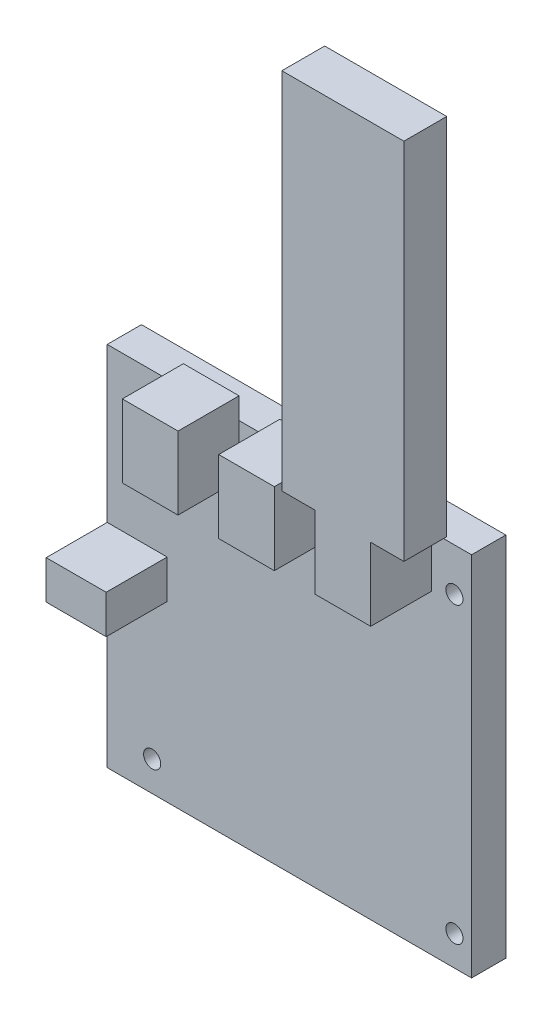
ISO-10303-21;
HEADER;
FILE_DESCRIPTION(('STEP AP214'),'2;1');
FILE_NAME('part.step','',(''),(''),'','','');
FILE_SCHEMA(('AUTOMOTIVE_DESIGN { 1 0 10303 214 1 1 1 1 }'));
ENDSEC;
DATA;
#1=APPLICATION_CONTEXT('core data for automotive mechanical design processes');
#2=APPLICATION_PROTOCOL_DEFINITION('international standard','automotive_design',2000,#1);
#3=PRODUCT_CONTEXT('',#1,'mechanical');
#4=PRODUCT('Part','Part','',(#3));
#5=PRODUCT_RELATED_PRODUCT_CATEGORY('part','',(#4));
#6=PRODUCT_DEFINITION_FORMATION('','',#4);
#7=PRODUCT_DEFINITION_CONTEXT('part definition',#1,'design');
#8=PRODUCT_DEFINITION('design','',#6,#7);
#9=PRODUCT_DEFINITION_SHAPE('','',#8);
#10=(LENGTH_UNIT() NAMED_UNIT(*) SI_UNIT(.MILLI.,.METRE.));
#11=(NAMED_UNIT(*) PLANE_ANGLE_UNIT() SI_UNIT($,.RADIAN.));
#12=(NAMED_UNIT(*) SI_UNIT($,.STERADIAN.) SOLID_ANGLE_UNIT());
#13=UNCERTAINTY_MEASURE_WITH_UNIT(LENGTH_MEASURE(1.E-05),#10,'distance_accuracy_value','');
#14=(GEOMETRIC_REPRESENTATION_CONTEXT(3) GLOBAL_UNCERTAINTY_ASSIGNED_CONTEXT((#13)) GLOBAL_UNIT_ASSIGNED_CONTEXT((#10,
#11,#12)) REPRESENTATION_CONTEXT('',''));
#15=CARTESIAN_POINT('',(0.,0.,0.));
#16=DIRECTION('',(0.,0.,1.));
#17=DIRECTION('',(1.,0.,0.));
#18=AXIS2_PLACEMENT_3D('',#15,#16,#17);
#19=CARTESIAN_POINT('',(20.245,47.8,22.25));
#20=DIRECTION('',(0.,-1.,0.));
#21=DIRECTION('',(0.,0.,-1.));
#22=AXIS2_PLACEMENT_3D('',#19,#20,#21);
#23=PLANE('',#22);
#24=DIRECTION('',(-1.,0.,0.));
#25=VECTOR('',#24,1.);
#26=CARTESIAN_POINT('',(12.495,47.8,12.25));
#27=LINE('',#26,#25);
#28=CARTESIAN_POINT('',(33.245,47.8,12.25));
#29=VERTEX_POINT('',#28);
#30=CARTESIAN_POINT('',(20.245,47.8,12.25));
#31=VERTEX_POINT('',#30);
#32=EDGE_CURVE('E11',#29,#31,#27,.T.);
#33=ORIENTED_EDGE('',*,*,#32,.F.);
#34=DIRECTION('',(0.,0.,-1.));
#35=VECTOR('',#34,1.);
#36=CARTESIAN_POINT('',(33.245,47.8,22.25));
#37=LINE('',#36,#35);
#38=CARTESIAN_POINT('',(33.245,47.8,8.));
#39=VERTEX_POINT('',#38);
#40=EDGE_CURVE('E281',#29,#39,#37,.T.);
#41=ORIENTED_EDGE('',*,*,#40,.T.);
#42=DIRECTION('',(-1.,0.,0.));
#43=VECTOR('',#42,1.);
#44=CARTESIAN_POINT('',(20.245,47.8,8.));
#45=LINE('',#44,#43);
#46=CARTESIAN_POINT('',(20.245,47.8,8.));
#47=VERTEX_POINT('',#46);
#48=EDGE_CURVE('E368',#39,#47,#45,.T.);
#49=ORIENTED_EDGE('',*,*,#48,.T.);
#50=DIRECTION('',(0.,0.,-1.));
#51=VECTOR('',#50,1.);
#52=CARTESIAN_POINT('',(20.245,47.8,22.25));
#53=LINE('',#52,#51);
#54=EDGE_CURVE('E282',#31,#47,#53,.T.);
#55=ORIENTED_EDGE('',*,*,#54,.F.);
#56=EDGE_LOOP('',(#33,#41,#49,#55));
#57=FACE_BOUND('',#56,.T.);
#58=ADVANCED_FACE('F33',(#57),#23,.F.);
#59=CARTESIAN_POINT('',(42.545,42.8,8.));
#60=DIRECTION('',(0.,0.,-1.));
#61=DIRECTION('',(-1.,0.,0.));
#62=AXIS2_PLACEMENT_3D('',#59,#60,#61);
#63=PLANE('',#62);
#64=CARTESIAN_POINT('',(38.545,-35.8,8.));
#65=DIRECTION('',(0.,0.,1.));
#66=DIRECTION('',(1.,0.,0.));
#67=AXIS2_PLACEMENT_3D('',#64,#65,#66);
#68=CIRCLE('',#67,2.);
#69=CARTESIAN_POINT('',(40.545,-35.8,8.));
#70=VERTEX_POINT('',#69);
#71=EDGE_CURVE('E303',#70,#70,#68,.T.);
#72=ORIENTED_EDGE('',*,*,#71,.F.);
#73=EDGE_LOOP('',(#72));
#74=FACE_BOUND('',#73,.T.);
#75=CARTESIAN_POINT('',(-32.045,32.8,8.));
#76=DIRECTION('',(0.,0.,1.));
#77=DIRECTION('',(1.,0.,0.));
#78=AXIS2_PLACEMENT_3D('',#75,#76,#77);
#79=CIRCLE('',#78,2.);
#80=CARTESIAN_POINT('',(-30.045,32.8,8.));
#81=VERTEX_POINT('',#80);
#82=EDGE_CURVE('E315',#81,#81,#79,.T.);
#83=ORIENTED_EDGE('',*,*,#82,.F.);
#84=EDGE_LOOP('',(#83));
#85=FACE_BOUND('',#84,.T.);
#86=CARTESIAN_POINT('',(38.545,32.8,8.));
#87=DIRECTION('',(0.,0.,1.));
#88=DIRECTION('',(1.,0.,0.));
#89=AXIS2_PLACEMENT_3D('',#86,#87,#88);
#90=CIRCLE('',#89,2.);
#91=CARTESIAN_POINT('',(40.545,32.8,8.));
#92=VERTEX_POINT('',#91);
#93=EDGE_CURVE('E309',#92,#92,#90,.T.);
#94=ORIENTED_EDGE('',*,*,#93,.F.);
#95=EDGE_LOOP('',(#94));
#96=FACE_BOUND('',#95,.T.);
#97=CARTESIAN_POINT('',(-32.045,-35.8,8.));
#98=DIRECTION('',(0.,0.,1.));
#99=DIRECTION('',(1.,0.,0.));
#100=AXIS2_PLACEMENT_3D('',#97,#98,#99);
#101=CIRCLE('',#100,2.);
#102=CARTESIAN_POINT('',(-30.045,-35.8,8.));
#103=VERTEX_POINT('',#102);
#104=EDGE_CURVE('E296',#103,#103,#101,.T.);
#105=ORIENTED_EDGE('',*,*,#104,.F.);
#106=EDGE_LOOP('',(#105));
#107=FACE_BOUND('',#106,.T.);
#108=DIRECTION('',(1.,0.,0.));
#109=VECTOR('',#108,1.);
#110=CARTESIAN_POINT('',(-42.545,-2.20000000000001,8.));
#111=LINE('',#110,#109);
#112=CARTESIAN_POINT('',(-42.545,-2.20000000000001,8.));
#113=VERTEX_POINT('',#112);
#114=CARTESIAN_POINT('',(-28.545,-2.20000000000001,8.));
#115=VERTEX_POINT('',#114);
#116=EDGE_CURVE('E476',#113,#115,#111,.T.);
#117=ORIENTED_EDGE('',*,*,#116,.F.);
#118=DIRECTION('',(0.,-1.,0.));
#119=VECTOR('',#118,1.);
#120=CARTESIAN_POINT('',(-42.545,-42.8,8.));
#121=LINE('',#120,#119);
#122=CARTESIAN_POINT('',(-42.545,-42.8,8.));
#123=VERTEX_POINT('',#122);
#124=EDGE_CURVE('E329',#113,#123,#121,.T.);
#125=ORIENTED_EDGE('',*,*,#124,.T.);
#126=DIRECTION('',(1.,0.,0.));
#127=VECTOR('',#126,1.);
#128=CARTESIAN_POINT('',(-42.545,-42.8,8.));
#129=LINE('',#128,#127);
#130=CARTESIAN_POINT('',(42.545,-42.8,8.));
#131=VERTEX_POINT('',#130);
#132=EDGE_CURVE('E333',#123,#131,#129,.T.);
#133=ORIENTED_EDGE('',*,*,#132,.T.);
#134=DIRECTION('',(0.,1.,0.));
#135=VECTOR('',#134,1.);
#136=CARTESIAN_POINT('',(42.545,-42.8,8.));
#137=LINE('',#136,#135);
#138=CARTESIAN_POINT('',(42.545,42.8,8.));
#139=VERTEX_POINT('',#138);
#140=EDGE_CURVE('E321',#131,#139,#137,.T.);
#141=ORIENTED_EDGE('',*,*,#140,.T.);
#142=DIRECTION('',(-1.,0.,0.));
#143=VECTOR('',#142,1.);
#144=CARTESIAN_POINT('',(-42.545,42.8,8.));
#145=LINE('',#144,#143);
#146=CARTESIAN_POINT('',(33.245,42.8,8.));
#147=VERTEX_POINT('',#146);
#148=EDGE_CURVE('E326',#139,#147,#145,.T.);
#149=ORIENTED_EDGE('',*,*,#148,.T.);
#150=DIRECTION('',(0.,1.,0.));
#151=VECTOR('',#150,1.);
#152=CARTESIAN_POINT('',(33.245,30.8,8.));
#153=LINE('',#152,#151);
#154=CARTESIAN_POINT('',(33.245,30.8,8.));
#155=VERTEX_POINT('',#154);
#156=EDGE_CURVE('E380',#155,#147,#153,.T.);
#157=ORIENTED_EDGE('',*,*,#156,.F.);
#158=DIRECTION('',(1.,0.,0.));
#159=VECTOR('',#158,1.);
#160=CARTESIAN_POINT('',(20.245,30.8,8.));
#161=LINE('',#160,#159);
#162=CARTESIAN_POINT('',(20.245,30.8,8.));
#163=VERTEX_POINT('',#162);
#164=EDGE_CURVE('E355',#163,#155,#161,.T.);
#165=ORIENTED_EDGE('',*,*,#164,.F.);
#166=DIRECTION('',(0.,-1.,0.));
#167=VECTOR('',#166,1.);
#168=CARTESIAN_POINT('',(20.245,30.8,8.));
#169=LINE('',#168,#167);
#170=CARTESIAN_POINT('',(20.245,42.8,8.));
#171=VERTEX_POINT('',#170);
#172=EDGE_CURVE('E42',#171,#163,#169,.T.);
#173=ORIENTED_EDGE('',*,*,#172,.F.);
#174=CARTESIAN_POINT('',(10.745,42.8,8.));
#175=VERTEX_POINT('',#174);
#176=EDGE_CURVE('E720',#171,#175,#145,.T.);
#177=ORIENTED_EDGE('',*,*,#176,.T.);
#178=DIRECTION('',(0.,1.,0.));
#179=VECTOR('',#178,1.);
#180=CARTESIAN_POINT('',(10.745,30.8,8.));
#181=LINE('',#180,#179);
#182=CARTESIAN_POINT('',(10.745,30.8,8.));
#183=VERTEX_POINT('',#182);
#184=EDGE_CURVE('E538',#183,#175,#181,.T.);
#185=ORIENTED_EDGE('',*,*,#184,.F.);
#186=DIRECTION('',(1.,0.,0.));
#187=VECTOR('',#186,1.);
#188=CARTESIAN_POINT('',(10.745,30.8,8.));
#189=LINE('',#188,#187);
#190=CARTESIAN_POINT('',(-2.255,30.8,8.));
#191=VERTEX_POINT('',#190);
#192=EDGE_CURVE('E531',#191,#183,#189,.T.);
#193=ORIENTED_EDGE('',*,*,#192,.F.);
#194=DIRECTION('',(0.,-1.,0.));
#195=VECTOR('',#194,1.);
#196=CARTESIAN_POINT('',(-2.255,30.8,8.));
#197=LINE('',#196,#195);
#198=CARTESIAN_POINT('',(-2.25500000000001,42.8,8.));
#199=VERTEX_POINT('',#198);
#200=EDGE_CURVE('E543',#199,#191,#197,.T.);
#201=ORIENTED_EDGE('',*,*,#200,.F.);
#202=CARTESIAN_POINT('',(-11.755,42.8,8.));
#203=VERTEX_POINT('',#202);
#204=EDGE_CURVE('E719',#199,#203,#145,.T.);
#205=ORIENTED_EDGE('',*,*,#204,.T.);
#206=DIRECTION('',(0.,1.,0.));
#207=VECTOR('',#206,1.);
#208=CARTESIAN_POINT('',(-11.755,30.8,8.));
#209=LINE('',#208,#207);
#210=CARTESIAN_POINT('',(-11.755,30.8,8.));
#211=VERTEX_POINT('',#210);
#212=EDGE_CURVE('E511',#211,#203,#209,.T.);
#213=ORIENTED_EDGE('',*,*,#212,.F.);
#214=DIRECTION('',(1.,0.,0.));
#215=VECTOR('',#214,1.);
#216=CARTESIAN_POINT('',(-24.755,30.8,8.));
#217=LINE('',#216,#215);
#218=CARTESIAN_POINT('',(-24.755,30.8,8.));
#219=VERTEX_POINT('',#218);
#220=EDGE_CURVE('E507',#219,#211,#217,.T.);
#221=ORIENTED_EDGE('',*,*,#220,.F.);
#222=DIRECTION('',(0.,-1.,0.));
#223=VECTOR('',#222,1.);
#224=CARTESIAN_POINT('',(-24.755,30.8,8.));
#225=LINE('',#224,#223);
#226=CARTESIAN_POINT('',(-24.755,42.8,8.));
#227=VERTEX_POINT('',#226);
#228=EDGE_CURVE('E484',#227,#219,#225,.T.);
#229=ORIENTED_EDGE('',*,*,#228,.F.);
#230=CARTESIAN_POINT('',(-42.545,42.8,8.));
#231=VERTEX_POINT('',#230);
#232=EDGE_CURVE('E324',#227,#231,#145,.T.);
#233=ORIENTED_EDGE('',*,*,#232,.T.);
#234=CARTESIAN_POINT('',(-42.545,6.79999999999999,8.));
#235=VERTEX_POINT('',#234);
#236=EDGE_CURVE('E331',#231,#235,#121,.T.);
#237=ORIENTED_EDGE('',*,*,#236,.T.);
#238=DIRECTION('',(-1.,0.,0.));
#239=VECTOR('',#238,1.);
#240=CARTESIAN_POINT('',(-42.545,6.79999999999999,8.));
#241=LINE('',#240,#239);
#242=CARTESIAN_POINT('',(-28.545,6.79999999999999,8.));
#243=VERTEX_POINT('',#242);
#244=EDGE_CURVE('E722',#243,#235,#241,.T.);
#245=ORIENTED_EDGE('',*,*,#244,.F.);
#246=DIRECTION('',(0.,1.,0.));
#247=VECTOR('',#246,1.);
#248=CARTESIAN_POINT('',(-28.545,6.79999999999999,8.));
#249=LINE('',#248,#247);
#250=EDGE_CURVE('E58',#115,#243,#249,.T.);
#251=ORIENTED_EDGE('',*,*,#250,.F.);
#252=EDGE_LOOP('',(#117,#125,#133,#141,#149,#157,#165,#173,#177,#185,#193,#201,#205,#213,#221,
#229,#233,#237,#245,#251));
#253=FACE_BOUND('',#252,.T.);
#254=ADVANCED_FACE('F415',(#74,#85,#96,#107,#253),#63,.F.);
#255=CARTESIAN_POINT('',(42.545,42.8,0.));
#256=DIRECTION('',(0.,0.,-1.));
#257=DIRECTION('',(-1.,0.,0.));
#258=AXIS2_PLACEMENT_3D('',#255,#256,#257);
#259=PLANE('',#258);
#260=CARTESIAN_POINT('',(38.545,-35.8,0.));
#261=DIRECTION('',(0.,0.,1.));
#262=DIRECTION('',(1.,0.,0.));
#263=AXIS2_PLACEMENT_3D('',#260,#261,#262);
#264=CIRCLE('',#263,2.);
#265=CARTESIAN_POINT('',(40.545,-35.8,0.));
#266=VERTEX_POINT('',#265);
#267=EDGE_CURVE('E299',#266,#266,#264,.T.);
#268=ORIENTED_EDGE('',*,*,#267,.T.);
#269=EDGE_LOOP('',(#268));
#270=FACE_BOUND('',#269,.T.);
#271=CARTESIAN_POINT('',(-32.045,32.8,0.));
#272=DIRECTION('',(0.,0.,1.));
#273=DIRECTION('',(1.,0.,0.));
#274=AXIS2_PLACEMENT_3D('',#271,#272,#273);
#275=CIRCLE('',#274,2.);
#276=CARTESIAN_POINT('',(-30.045,32.8,0.));
#277=VERTEX_POINT('',#276);
#278=EDGE_CURVE('E312',#277,#277,#275,.T.);
#279=ORIENTED_EDGE('',*,*,#278,.T.);
#280=EDGE_LOOP('',(#279));
#281=FACE_BOUND('',#280,.T.);
#282=DIRECTION('',(0.,1.,0.));
#283=VECTOR('',#282,1.);
#284=CARTESIAN_POINT('',(42.545,-42.8,0.));
#285=LINE('',#284,#283);
#286=CARTESIAN_POINT('',(42.545,-42.8,0.));
#287=VERTEX_POINT('',#286);
#288=CARTESIAN_POINT('',(42.545,42.8,0.));
#289=VERTEX_POINT('',#288);
#290=EDGE_CURVE('E318',#287,#289,#285,.T.);
#291=ORIENTED_EDGE('',*,*,#290,.F.);
#292=DIRECTION('',(1.,0.,0.));
#293=VECTOR('',#292,1.);
#294=CARTESIAN_POINT('',(-42.545,-42.8,0.));
#295=LINE('',#294,#293);
#296=CARTESIAN_POINT('',(-42.545,-42.8,0.));
#297=VERTEX_POINT('',#296);
#298=EDGE_CURVE('E325',#297,#287,#295,.T.);
#299=ORIENTED_EDGE('',*,*,#298,.F.);
#300=DIRECTION('',(0.,-1.,0.));
#301=VECTOR('',#300,1.);
#302=CARTESIAN_POINT('',(-42.545,-42.8,0.));
#303=LINE('',#302,#301);
#304=CARTESIAN_POINT('',(-42.545,42.8,0.));
#305=VERTEX_POINT('',#304);
#306=EDGE_CURVE('E340',#305,#297,#303,.T.);
#307=ORIENTED_EDGE('',*,*,#306,.F.);
#308=DIRECTION('',(-1.,0.,0.));
#309=VECTOR('',#308,1.);
#310=CARTESIAN_POINT('',(-42.545,42.8,0.));
#311=LINE('',#310,#309);
#312=EDGE_CURVE('E338',#289,#305,#311,.T.);
#313=ORIENTED_EDGE('',*,*,#312,.F.);
#314=EDGE_LOOP('',(#291,#299,#307,#313));
#315=FACE_BOUND('',#314,.T.);
#316=CARTESIAN_POINT('',(38.545,32.8,0.));
#317=DIRECTION('',(0.,0.,1.));
#318=DIRECTION('',(1.,0.,0.));
#319=AXIS2_PLACEMENT_3D('',#316,#317,#318);
#320=CIRCLE('',#319,2.);
#321=CARTESIAN_POINT('',(40.545,32.8,0.));
#322=VERTEX_POINT('',#321);
#323=EDGE_CURVE('E306',#322,#322,#320,.T.);
#324=ORIENTED_EDGE('',*,*,#323,.T.);
#325=EDGE_LOOP('',(#324));
#326=FACE_BOUND('',#325,.T.);
#327=CARTESIAN_POINT('',(-32.045,-35.8,0.));
#328=DIRECTION('',(0.,0.,1.));
#329=DIRECTION('',(1.,0.,0.));
#330=AXIS2_PLACEMENT_3D('',#327,#328,#329);
#331=CIRCLE('',#330,2.);
#332=CARTESIAN_POINT('',(-30.045,-35.8,0.));
#333=VERTEX_POINT('',#332);
#334=EDGE_CURVE('E300',#333,#333,#331,.T.);
#335=ORIENTED_EDGE('',*,*,#334,.T.);
#336=EDGE_LOOP('',(#335));
#337=FACE_BOUND('',#336,.T.);
#338=ADVANCED_FACE('F422',(#270,#281,#315,#326,#337),#259,.T.);
#339=CARTESIAN_POINT('',(42.545,-42.8,8.));
#340=DIRECTION('',(-1.,0.,0.));
#341=DIRECTION('',(0.,0.,1.));
#342=AXIS2_PLACEMENT_3D('',#339,#340,#341);
#343=PLANE('',#342);
#344=ORIENTED_EDGE('',*,*,#290,.T.);
#345=DIRECTION('',(0.,0.,-1.));
#346=VECTOR('',#345,1.);
#347=CARTESIAN_POINT('',(42.545,42.8,8.));
#348=LINE('',#347,#346);
#349=EDGE_CURVE('E351',#139,#289,#348,.T.);
#350=ORIENTED_EDGE('',*,*,#349,.F.);
#351=ORIENTED_EDGE('',*,*,#140,.F.);
#352=DIRECTION('',(0.,0.,-1.));
#353=VECTOR('',#352,1.);
#354=CARTESIAN_POINT('',(42.545,-42.8,8.));
#355=LINE('',#354,#353);
#356=EDGE_CURVE('E335',#131,#287,#355,.T.);
#357=ORIENTED_EDGE('',*,*,#356,.T.);
#358=EDGE_LOOP('',(#344,#350,#351,#357));
#359=FACE_BOUND('',#358,.T.);
#360=ADVANCED_FACE('F35',(#359),#343,.F.);
#361=CARTESIAN_POINT('',(-42.545,42.8,8.));
#362=DIRECTION('',(0.,-1.,0.));
#363=DIRECTION('',(0.,0.,-1.));
#364=AXIS2_PLACEMENT_3D('',#361,#362,#363);
#365=PLANE('',#364);
#366=ORIENTED_EDGE('',*,*,#312,.T.);
#367=DIRECTION('',(0.,0.,-1.));
#368=VECTOR('',#367,1.);
#369=CARTESIAN_POINT('',(-42.545,42.8,8.));
#370=LINE('',#369,#368);
#371=EDGE_CURVE('E348',#231,#305,#370,.T.);
#372=ORIENTED_EDGE('',*,*,#371,.F.);
#373=ORIENTED_EDGE('',*,*,#232,.F.);
#374=EDGE_CURVE('E717',#203,#227,#145,.T.);
#375=ORIENTED_EDGE('',*,*,#374,.F.);
#376=ORIENTED_EDGE('',*,*,#204,.F.);
#377=EDGE_CURVE('E571',#175,#199,#145,.T.);
#378=ORIENTED_EDGE('',*,*,#377,.F.);
#379=ORIENTED_EDGE('',*,*,#176,.F.);
#380=EDGE_CURVE('E330',#147,#171,#145,.T.);
#381=ORIENTED_EDGE('',*,*,#380,.F.);
#382=ORIENTED_EDGE('',*,*,#148,.F.);
#383=ORIENTED_EDGE('',*,*,#349,.T.);
#384=EDGE_LOOP('',(#366,#372,#373,#375,#376,#378,#379,#381,#382,#383));
#385=FACE_BOUND('',#384,.T.);
#386=ADVANCED_FACE('F454',(#385),#365,.F.);
#387=CARTESIAN_POINT('',(-42.545,-42.8,8.));
#388=DIRECTION('',(1.,0.,0.));
#389=DIRECTION('',(0.,0.,-1.));
#390=AXIS2_PLACEMENT_3D('',#387,#388,#389);
#391=PLANE('',#390);
#392=CARTESIAN_POINT('',(-42.545,2.29999999999999,16.25));
#393=DIRECTION('',(-1.,0.,0.));
#394=DIRECTION('',(0.,0.,1.));
#395=AXIS2_PLACEMENT_3D('',#392,#393,#394);
#396=CIRCLE('',#395,2.5);
#397=CARTESIAN_POINT('',(-42.545,2.29999999999999,18.75));
#398=VERTEX_POINT('',#397);
#399=EDGE_CURVE('E248',#398,#398,#396,.T.);
#400=ORIENTED_EDGE('',*,*,#399,.F.);
#401=EDGE_LOOP('',(#400));
#402=FACE_BOUND('',#401,.T.);
#403=ORIENTED_EDGE('',*,*,#306,.T.);
#404=DIRECTION('',(0.,0.,-1.));
#405=VECTOR('',#404,1.);
#406=CARTESIAN_POINT('',(-42.545,-42.8,8.));
#407=LINE('',#406,#405);
#408=EDGE_CURVE('E345',#123,#297,#407,.T.);
#409=ORIENTED_EDGE('',*,*,#408,.F.);
#410=ORIENTED_EDGE('',*,*,#124,.F.);
#411=DIRECTION('',(0.,0.,-1.));
#412=VECTOR('',#411,1.);
#413=CARTESIAN_POINT('',(-42.545,-2.20000000000001,22.25));
#414=LINE('',#413,#412);
#415=CARTESIAN_POINT('',(-42.545,-2.20000000000001,22.25));
#416=VERTEX_POINT('',#415);
#417=EDGE_CURVE('E480',#416,#113,#414,.T.);
#418=ORIENTED_EDGE('',*,*,#417,.F.);
#419=DIRECTION('',(0.,-1.,0.));
#420=VECTOR('',#419,1.);
#421=CARTESIAN_POINT('',(-42.545,6.79999999999999,22.25));
#422=LINE('',#421,#420);
#423=CARTESIAN_POINT('',(-42.545,6.79999999999999,22.25));
#424=VERTEX_POINT('',#423);
#425=EDGE_CURVE('E482',#424,#416,#422,.T.);
#426=ORIENTED_EDGE('',*,*,#425,.F.);
#427=DIRECTION('',(0.,0.,-1.));
#428=VECTOR('',#427,1.);
#429=CARTESIAN_POINT('',(-42.545,6.79999999999999,22.25));
#430=LINE('',#429,#428);
#431=EDGE_CURVE('E726',#424,#235,#430,.T.);
#432=ORIENTED_EDGE('',*,*,#431,.T.);
#433=ORIENTED_EDGE('',*,*,#236,.F.);
#434=ORIENTED_EDGE('',*,*,#371,.T.);
#435=EDGE_LOOP('',(#403,#409,#410,#418,#426,#432,#433,#434));
#436=FACE_BOUND('',#435,.T.);
#437=ADVANCED_FACE('F451',(#402,#436),#391,.F.);
#438=CARTESIAN_POINT('',(-42.545,-42.8,8.));
#439=DIRECTION('',(0.,1.,0.));
#440=DIRECTION('',(0.,0.,1.));
#441=AXIS2_PLACEMENT_3D('',#438,#439,#440);
#442=PLANE('',#441);
#443=ORIENTED_EDGE('',*,*,#298,.T.);
#444=ORIENTED_EDGE('',*,*,#356,.F.);
#445=ORIENTED_EDGE('',*,*,#132,.F.);
#446=ORIENTED_EDGE('',*,*,#408,.T.);
#447=EDGE_LOOP('',(#443,#444,#445,#446));
#448=FACE_BOUND('',#447,.T.);
#449=ADVANCED_FACE('F443',(#448),#442,.F.);
#450=CARTESIAN_POINT('',(-32.045,32.8,8.));
#451=DIRECTION('',(0.,0.,-1.));
#452=DIRECTION('',(-1.,0.,0.));
#453=AXIS2_PLACEMENT_3D('',#450,#451,#452);
#454=CYLINDRICAL_SURFACE('',#453,2.);
#455=ORIENTED_EDGE('',*,*,#82,.T.);
#456=EDGE_LOOP('',(#455));
#457=FACE_BOUND('',#456,.T.);
#458=ORIENTED_EDGE('',*,*,#278,.F.);
#459=EDGE_LOOP('',(#458));
#460=FACE_BOUND('',#459,.T.);
#461=ADVANCED_FACE('F440',(#457,#460),#454,.F.);
#462=CARTESIAN_POINT('',(38.545,32.8,8.));
#463=DIRECTION('',(0.,0.,-1.));
#464=DIRECTION('',(-1.,0.,0.));
#465=AXIS2_PLACEMENT_3D('',#462,#463,#464);
#466=CYLINDRICAL_SURFACE('',#465,2.);
#467=ORIENTED_EDGE('',*,*,#93,.T.);
#468=EDGE_LOOP('',(#467));
#469=FACE_BOUND('',#468,.T.);
#470=ORIENTED_EDGE('',*,*,#323,.F.);
#471=EDGE_LOOP('',(#470));
#472=FACE_BOUND('',#471,.T.);
#473=ADVANCED_FACE('F436',(#469,#472),#466,.F.);
#474=CARTESIAN_POINT('',(38.545,-35.8,8.));
#475=DIRECTION('',(0.,0.,-1.));
#476=DIRECTION('',(-1.,0.,0.));
#477=AXIS2_PLACEMENT_3D('',#474,#475,#476);
#478=CYLINDRICAL_SURFACE('',#477,2.);
#479=ORIENTED_EDGE('',*,*,#71,.T.);
#480=EDGE_LOOP('',(#479));
#481=FACE_BOUND('',#480,.T.);
#482=ORIENTED_EDGE('',*,*,#267,.F.);
#483=EDGE_LOOP('',(#482));
#484=FACE_BOUND('',#483,.T.);
#485=ADVANCED_FACE('F432',(#481,#484),#478,.F.);
#486=CARTESIAN_POINT('',(-32.045,-35.8,8.));
#487=DIRECTION('',(0.,0.,-1.));
#488=DIRECTION('',(-1.,0.,0.));
#489=AXIS2_PLACEMENT_3D('',#486,#487,#488);
#490=CYLINDRICAL_SURFACE('',#489,2.);
#491=ORIENTED_EDGE('',*,*,#104,.T.);
#492=EDGE_LOOP('',(#491));
#493=FACE_BOUND('',#492,.T.);
#494=ORIENTED_EDGE('',*,*,#334,.F.);
#495=EDGE_LOOP('',(#494));
#496=FACE_BOUND('',#495,.T.);
#497=ADVANCED_FACE('F429',(#493,#496),#490,.F.);
#498=CARTESIAN_POINT('',(33.245,30.8,22.25));
#499=DIRECTION('',(-1.,0.,0.));
#500=DIRECTION('',(0.,0.,1.));
#501=AXIS2_PLACEMENT_3D('',#498,#499,#500);
#502=PLANE('',#501);
#503=ORIENTED_EDGE('',*,*,#156,.T.);
#504=EDGE_CURVE('E381',#147,#39,#153,.T.);
#505=ORIENTED_EDGE('',*,*,#504,.T.);
#506=ORIENTED_EDGE('',*,*,#40,.F.);
#507=CARTESIAN_POINT('',(33.245,47.8,22.25));
#508=VERTEX_POINT('',#507);
#509=EDGE_CURVE('E284',#508,#29,#37,.T.);
#510=ORIENTED_EDGE('',*,*,#509,.F.);
#511=DIRECTION('',(0.,1.,0.));
#512=VECTOR('',#511,1.);
#513=CARTESIAN_POINT('',(33.245,30.8,22.25));
#514=LINE('',#513,#512);
#515=CARTESIAN_POINT('',(33.245,30.8,22.25));
#516=VERTEX_POINT('',#515);
#517=EDGE_CURVE('E354',#516,#508,#514,.T.);
#518=ORIENTED_EDGE('',*,*,#517,.F.);
#519=DIRECTION('',(0.,0.,-1.));
#520=VECTOR('',#519,1.);
#521=CARTESIAN_POINT('',(33.245,30.8,22.25));
#522=LINE('',#521,#520);
#523=EDGE_CURVE('E371',#516,#155,#522,.T.);
#524=ORIENTED_EDGE('',*,*,#523,.T.);
#525=EDGE_LOOP('',(#503,#505,#506,#510,#518,#524));
#526=FACE_BOUND('',#525,.T.);
#527=ADVANCED_FACE('F396',(#526),#502,.F.);
#528=CARTESIAN_POINT('',(20.245,30.8,22.25));
#529=DIRECTION('',(1.,0.,0.));
#530=DIRECTION('',(0.,0.,-1.));
#531=AXIS2_PLACEMENT_3D('',#528,#529,#530);
#532=PLANE('',#531);
#533=EDGE_CURVE('E361',#47,#171,#169,.T.);
#534=ORIENTED_EDGE('',*,*,#533,.T.);
#535=ORIENTED_EDGE('',*,*,#172,.T.);
#536=DIRECTION('',(0.,0.,-1.));
#537=VECTOR('',#536,1.);
#538=CARTESIAN_POINT('',(20.245,30.8,22.25));
#539=LINE('',#538,#537);
#540=CARTESIAN_POINT('',(20.245,30.8,22.25));
#541=VERTEX_POINT('',#540);
#542=EDGE_CURVE('E286',#541,#163,#539,.T.);
#543=ORIENTED_EDGE('',*,*,#542,.F.);
#544=DIRECTION('',(0.,-1.,0.));
#545=VECTOR('',#544,1.);
#546=CARTESIAN_POINT('',(20.245,30.8,22.25));
#547=LINE('',#546,#545);
#548=CARTESIAN_POINT('',(20.245,47.8,22.25));
#549=VERTEX_POINT('',#548);
#550=EDGE_CURVE('E290',#549,#541,#547,.T.);
#551=ORIENTED_EDGE('',*,*,#550,.F.);
#552=EDGE_CURVE('E279',#549,#31,#53,.T.);
#553=ORIENTED_EDGE('',*,*,#552,.T.);
#554=ORIENTED_EDGE('',*,*,#54,.T.);
#555=EDGE_LOOP('',(#534,#535,#543,#551,#553,#554));
#556=FACE_BOUND('',#555,.T.);
#557=ADVANCED_FACE('F391',(#556),#532,.F.);
#558=CARTESIAN_POINT('',(20.245,30.8,22.25));
#559=DIRECTION('',(0.,1.,0.));
#560=DIRECTION('',(0.,0.,1.));
#561=AXIS2_PLACEMENT_3D('',#558,#559,#560);
#562=PLANE('',#561);
#563=ORIENTED_EDGE('',*,*,#164,.T.);
#564=ORIENTED_EDGE('',*,*,#523,.F.);
#565=DIRECTION('',(1.,0.,0.));
#566=VECTOR('',#565,1.);
#567=CARTESIAN_POINT('',(20.245,30.8,22.25));
#568=LINE('',#567,#566);
#569=EDGE_CURVE('E359',#541,#516,#568,.T.);
#570=ORIENTED_EDGE('',*,*,#569,.F.);
#571=ORIENTED_EDGE('',*,*,#542,.T.);
#572=EDGE_LOOP('',(#563,#564,#570,#571));
#573=FACE_BOUND('',#572,.T.);
#574=ADVANCED_FACE('F395',(#573),#562,.F.);
#575=CARTESIAN_POINT('',(33.245,47.8,22.25));
#576=DIRECTION('',(0.,0.,-1.));
#577=DIRECTION('',(-1.,0.,0.));
#578=AXIS2_PLACEMENT_3D('',#575,#576,#577);
#579=PLANE('',#578);
#580=ORIENTED_EDGE('',*,*,#517,.T.);
#581=DIRECTION('',(1.,0.,0.));
#582=VECTOR('',#581,1.);
#583=CARTESIAN_POINT('',(12.495,47.8,22.25));
#584=LINE('',#583,#582);
#585=CARTESIAN_POINT('',(40.995,47.8,22.25));
#586=VERTEX_POINT('',#585);
#587=EDGE_CURVE('E260',#508,#586,#584,.T.);
#588=ORIENTED_EDGE('',*,*,#587,.T.);
#589=DIRECTION('',(0.,-1.,0.));
#590=VECTOR('',#589,1.);
#591=CARTESIAN_POINT('',(40.995,132.8,22.25));
#592=LINE('',#591,#590);
#593=CARTESIAN_POINT('',(40.995,132.8,22.25));
#594=VERTEX_POINT('',#593);
#595=EDGE_CURVE('E266',#594,#586,#592,.T.);
#596=ORIENTED_EDGE('',*,*,#595,.F.);
#597=DIRECTION('',(1.,0.,0.));
#598=VECTOR('',#597,1.);
#599=CARTESIAN_POINT('',(12.495,132.8,22.25));
#600=LINE('',#599,#598);
#601=CARTESIAN_POINT('',(12.495,132.8,22.25));
#602=VERTEX_POINT('',#601);
#603=EDGE_CURVE('E239',#602,#594,#600,.T.);
#604=ORIENTED_EDGE('',*,*,#603,.F.);
#605=DIRECTION('',(0.,-1.,0.));
#606=VECTOR('',#605,1.);
#607=CARTESIAN_POINT('',(12.495,132.8,22.25));
#608=LINE('',#607,#606);
#609=CARTESIAN_POINT('',(12.495,47.8,22.25));
#610=VERTEX_POINT('',#609);
#611=EDGE_CURVE('E253',#602,#610,#608,.T.);
#612=ORIENTED_EDGE('',*,*,#611,.T.);
#613=EDGE_CURVE('E243',#610,#549,#584,.T.);
#614=ORIENTED_EDGE('',*,*,#613,.T.);
#615=ORIENTED_EDGE('',*,*,#550,.T.);
#616=ORIENTED_EDGE('',*,*,#569,.T.);
#617=EDGE_LOOP('',(#580,#588,#596,#604,#612,#614,#615,#616));
#618=FACE_BOUND('',#617,.T.);
#619=ADVANCED_FACE('F272',(#618),#579,.F.);
#620=CARTESIAN_POINT('',(33.245,47.8,8.));
#621=DIRECTION('',(0.,0.,-1.));
#622=DIRECTION('',(-1.,0.,0.));
#623=AXIS2_PLACEMENT_3D('',#620,#621,#622);
#624=PLANE('',#623);
#625=ORIENTED_EDGE('',*,*,#504,.F.);
#626=ORIENTED_EDGE('',*,*,#380,.T.);
#627=ORIENTED_EDGE('',*,*,#533,.F.);
#628=ORIENTED_EDGE('',*,*,#48,.F.);
#629=EDGE_LOOP('',(#625,#626,#627,#628));
#630=FACE_BOUND('',#629,.T.);
#631=ADVANCED_FACE('F389',(#630),#624,.T.);
#632=CARTESIAN_POINT('',(10.745,47.8,8.));
#633=DIRECTION('',(0.,0.,1.));
#634=DIRECTION('',(1.,0.,0.));
#635=AXIS2_PLACEMENT_3D('',#632,#633,#634);
#636=PLANE('',#635);
#637=CARTESIAN_POINT('',(10.745,47.8,8.));
#638=VERTEX_POINT('',#637);
#639=EDGE_CURVE('E526',#175,#638,#181,.T.);
#640=ORIENTED_EDGE('',*,*,#639,.F.);
#641=ORIENTED_EDGE('',*,*,#377,.T.);
#642=CARTESIAN_POINT('',(-2.25500000000001,47.8,8.));
#643=VERTEX_POINT('',#642);
#644=EDGE_CURVE('E544',#643,#199,#197,.T.);
#645=ORIENTED_EDGE('',*,*,#644,.F.);
#646=DIRECTION('',(-1.,0.,0.));
#647=VECTOR('',#646,1.);
#648=CARTESIAN_POINT('',(10.745,47.8,8.));
#649=LINE('',#648,#647);
#650=EDGE_CURVE('E541',#638,#643,#649,.T.);
#651=ORIENTED_EDGE('',*,*,#650,.F.);
#652=EDGE_LOOP('',(#640,#641,#645,#651));
#653=FACE_BOUND('',#652,.T.);
#654=ADVANCED_FACE('F570',(#653),#636,.F.);
#655=CARTESIAN_POINT('',(10.745,30.8,22.25));
#656=DIRECTION('',(-1.,0.,0.));
#657=DIRECTION('',(0.,0.,1.));
#658=AXIS2_PLACEMENT_3D('',#655,#656,#657);
#659=PLANE('',#658);
#660=ORIENTED_EDGE('',*,*,#184,.T.);
#661=ORIENTED_EDGE('',*,*,#639,.T.);
#662=DIRECTION('',(0.,0.,-1.));
#663=VECTOR('',#662,1.);
#664=CARTESIAN_POINT('',(10.745,47.8,22.25));
#665=LINE('',#664,#663);
#666=CARTESIAN_POINT('',(10.745,47.8,22.25));
#667=VERTEX_POINT('',#666);
#668=EDGE_CURVE('E378',#667,#638,#665,.T.);
#669=ORIENTED_EDGE('',*,*,#668,.F.);
#670=DIRECTION('',(0.,1.,0.));
#671=VECTOR('',#670,1.);
#672=CARTESIAN_POINT('',(10.745,30.8,22.25));
#673=LINE('',#672,#671);
#674=CARTESIAN_POINT('',(10.745,30.8,22.25));
#675=VERTEX_POINT('',#674);
#676=EDGE_CURVE('E527',#675,#667,#673,.T.);
#677=ORIENTED_EDGE('',*,*,#676,.F.);
#678=DIRECTION('',(0.,0.,-1.));
#679=VECTOR('',#678,1.);
#680=CARTESIAN_POINT('',(10.745,30.8,22.25));
#681=LINE('',#680,#679);
#682=EDGE_CURVE('E537',#675,#183,#681,.T.);
#683=ORIENTED_EDGE('',*,*,#682,.T.);
#684=EDGE_LOOP('',(#660,#661,#669,#677,#683));
#685=FACE_BOUND('',#684,.T.);
#686=ADVANCED_FACE('F566',(#685),#659,.F.);
#687=CARTESIAN_POINT('',(10.745,47.8,22.25));
#688=DIRECTION('',(0.,-1.,0.));
#689=DIRECTION('',(0.,0.,-1.));
#690=AXIS2_PLACEMENT_3D('',#687,#688,#689);
#691=PLANE('',#690);
#692=ORIENTED_EDGE('',*,*,#650,.T.);
#693=DIRECTION('',(0.,0.,-1.));
#694=VECTOR('',#693,1.);
#695=CARTESIAN_POINT('',(-2.25500000000001,47.8,22.25));
#696=LINE('',#695,#694);
#697=CARTESIAN_POINT('',(-2.25500000000001,47.8,22.25));
#698=VERTEX_POINT('',#697);
#699=EDGE_CURVE('E553',#698,#643,#696,.T.);
#700=ORIENTED_EDGE('',*,*,#699,.F.);
#701=DIRECTION('',(-1.,0.,0.));
#702=VECTOR('',#701,1.);
#703=CARTESIAN_POINT('',(10.745,47.8,22.25));
#704=LINE('',#703,#702);
#705=EDGE_CURVE('E530',#667,#698,#704,.T.);
#706=ORIENTED_EDGE('',*,*,#705,.F.);
#707=ORIENTED_EDGE('',*,*,#668,.T.);
#708=EDGE_LOOP('',(#692,#700,#706,#707));
#709=FACE_BOUND('',#708,.T.);
#710=ADVANCED_FACE('F562',(#709),#691,.F.);
#711=CARTESIAN_POINT('',(-2.255,30.8,22.25));
#712=DIRECTION('',(1.,0.,0.));
#713=DIRECTION('',(0.,1.,0.));
#714=AXIS2_PLACEMENT_3D('',#711,#712,#713);
#715=PLANE('',#714);
#716=ORIENTED_EDGE('',*,*,#644,.T.);
#717=ORIENTED_EDGE('',*,*,#200,.T.);
#718=DIRECTION('',(0.,0.,-1.));
#719=VECTOR('',#718,1.);
#720=CARTESIAN_POINT('',(-2.255,30.8,22.25));
#721=LINE('',#720,#719);
#722=CARTESIAN_POINT('',(-2.255,30.8,22.25));
#723=VERTEX_POINT('',#722);
#724=EDGE_CURVE('E551',#723,#191,#721,.T.);
#725=ORIENTED_EDGE('',*,*,#724,.F.);
#726=DIRECTION('',(0.,-1.,0.));
#727=VECTOR('',#726,1.);
#728=CARTESIAN_POINT('',(-2.255,30.8,22.25));
#729=LINE('',#728,#727);
#730=EDGE_CURVE('E533',#698,#723,#729,.T.);
#731=ORIENTED_EDGE('',*,*,#730,.F.);
#732=ORIENTED_EDGE('',*,*,#699,.T.);
#733=EDGE_LOOP('',(#716,#717,#725,#731,#732));
#734=FACE_BOUND('',#733,.T.);
#735=ADVANCED_FACE('F573',(#734),#715,.F.);
#736=CARTESIAN_POINT('',(10.745,30.8,22.25));
#737=DIRECTION('',(0.,1.,0.));
#738=DIRECTION('',(0.,0.,1.));
#739=AXIS2_PLACEMENT_3D('',#736,#737,#738);
#740=PLANE('',#739);
#741=ORIENTED_EDGE('',*,*,#192,.T.);
#742=ORIENTED_EDGE('',*,*,#682,.F.);
#743=DIRECTION('',(1.,0.,0.));
#744=VECTOR('',#743,1.);
#745=CARTESIAN_POINT('',(10.745,30.8,22.25));
#746=LINE('',#745,#744);
#747=EDGE_CURVE('E535',#723,#675,#746,.T.);
#748=ORIENTED_EDGE('',*,*,#747,.F.);
#749=ORIENTED_EDGE('',*,*,#724,.T.);
#750=EDGE_LOOP('',(#741,#742,#748,#749));
#751=FACE_BOUND('',#750,.T.);
#752=ADVANCED_FACE('F579',(#751),#740,.F.);
#753=CARTESIAN_POINT('',(10.745,47.8,22.25));
#754=DIRECTION('',(0.,0.,1.));
#755=DIRECTION('',(1.,0.,0.));
#756=AXIS2_PLACEMENT_3D('',#753,#754,#755);
#757=PLANE('',#756);
#758=ORIENTED_EDGE('',*,*,#676,.T.);
#759=ORIENTED_EDGE('',*,*,#705,.T.);
#760=ORIENTED_EDGE('',*,*,#730,.T.);
#761=ORIENTED_EDGE('',*,*,#747,.T.);
#762=EDGE_LOOP('',(#758,#759,#760,#761));
#763=FACE_BOUND('',#762,.T.);
#764=ADVANCED_FACE('F582',(#763),#757,.T.);
#765=CARTESIAN_POINT('',(-24.755,47.8,8.));
#766=DIRECTION('',(0.,0.,-1.));
#767=DIRECTION('',(-1.,0.,0.));
#768=AXIS2_PLACEMENT_3D('',#765,#766,#767);
#769=PLANE('',#768);
#770=ORIENTED_EDGE('',*,*,#374,.T.);
#771=CARTESIAN_POINT('',(-24.755,47.8,8.));
#772=VERTEX_POINT('',#771);
#773=EDGE_CURVE('E488',#772,#227,#225,.T.);
#774=ORIENTED_EDGE('',*,*,#773,.F.);
#775=DIRECTION('',(-1.,0.,0.));
#776=VECTOR('',#775,1.);
#777=CARTESIAN_POINT('',(-24.755,47.8,8.));
#778=LINE('',#777,#776);
#779=CARTESIAN_POINT('',(-11.755,47.8,8.));
#780=VERTEX_POINT('',#779);
#781=EDGE_CURVE('E499',#780,#772,#778,.T.);
#782=ORIENTED_EDGE('',*,*,#781,.F.);
#783=EDGE_CURVE('E510',#203,#780,#209,.T.);
#784=ORIENTED_EDGE('',*,*,#783,.F.);
#785=EDGE_LOOP('',(#770,#774,#782,#784));
#786=FACE_BOUND('',#785,.T.);
#787=ADVANCED_FACE('F584',(#786),#769,.T.);
#788=CARTESIAN_POINT('',(-24.755,30.8,22.25));
#789=DIRECTION('',(1.,0.,0.));
#790=DIRECTION('',(0.,0.,-1.));
#791=AXIS2_PLACEMENT_3D('',#788,#789,#790);
#792=PLANE('',#791);
#793=ORIENTED_EDGE('',*,*,#773,.T.);
#794=ORIENTED_EDGE('',*,*,#228,.T.);
#795=DIRECTION('',(0.,0.,-1.));
#796=VECTOR('',#795,1.);
#797=CARTESIAN_POINT('',(-24.755,30.8,22.25));
#798=LINE('',#797,#796);
#799=CARTESIAN_POINT('',(-24.755,30.8,22.25));
#800=VERTEX_POINT('',#799);
#801=EDGE_CURVE('E523',#800,#219,#798,.T.);
#802=ORIENTED_EDGE('',*,*,#801,.F.);
#803=DIRECTION('',(0.,-1.,0.));
#804=VECTOR('',#803,1.);
#805=CARTESIAN_POINT('',(-24.755,30.8,22.25));
#806=LINE('',#805,#804);
#807=CARTESIAN_POINT('',(-24.755,47.8,22.25));
#808=VERTEX_POINT('',#807);
#809=EDGE_CURVE('E495',#808,#800,#806,.T.);
#810=ORIENTED_EDGE('',*,*,#809,.F.);
#811=DIRECTION('',(0.,0.,-1.));
#812=VECTOR('',#811,1.);
#813=CARTESIAN_POINT('',(-24.755,47.8,22.25));
#814=LINE('',#813,#812);
#815=EDGE_CURVE('E504',#808,#772,#814,.T.);
#816=ORIENTED_EDGE('',*,*,#815,.T.);
#817=EDGE_LOOP('',(#793,#794,#802,#810,#816));
#818=FACE_BOUND('',#817,.T.);
#819=ADVANCED_FACE('F590',(#818),#792,.F.);
#820=CARTESIAN_POINT('',(-24.755,30.8,22.25));
#821=DIRECTION('',(0.,1.,0.));
#822=DIRECTION('',(0.,0.,1.));
#823=AXIS2_PLACEMENT_3D('',#820,#821,#822);
#824=PLANE('',#823);
#825=ORIENTED_EDGE('',*,*,#220,.T.);
#826=DIRECTION('',(0.,0.,-1.));
#827=VECTOR('',#826,1.);
#828=CARTESIAN_POINT('',(-11.755,30.8,22.25));
#829=LINE('',#828,#827);
#830=CARTESIAN_POINT('',(-11.755,30.8,22.25));
#831=VERTEX_POINT('',#830);
#832=EDGE_CURVE('E520',#831,#211,#829,.T.);
#833=ORIENTED_EDGE('',*,*,#832,.F.);
#834=DIRECTION('',(1.,0.,0.));
#835=VECTOR('',#834,1.);
#836=CARTESIAN_POINT('',(-24.755,30.8,22.25));
#837=LINE('',#836,#835);
#838=EDGE_CURVE('E498',#800,#831,#837,.T.);
#839=ORIENTED_EDGE('',*,*,#838,.F.);
#840=ORIENTED_EDGE('',*,*,#801,.T.);
#841=EDGE_LOOP('',(#825,#833,#839,#840));
#842=FACE_BOUND('',#841,.T.);
#843=ADVANCED_FACE('F698',(#842),#824,.F.);
#844=CARTESIAN_POINT('',(-11.755,30.8,22.25));
#845=DIRECTION('',(-1.,0.,0.));
#846=DIRECTION('',(0.,0.,1.));
#847=AXIS2_PLACEMENT_3D('',#844,#845,#846);
#848=PLANE('',#847);
#849=ORIENTED_EDGE('',*,*,#212,.T.);
#850=ORIENTED_EDGE('',*,*,#783,.T.);
#851=DIRECTION('',(0.,0.,-1.));
#852=VECTOR('',#851,1.);
#853=CARTESIAN_POINT('',(-11.755,47.8,22.25));
#854=LINE('',#853,#852);
#855=CARTESIAN_POINT('',(-11.755,47.8,22.25));
#856=VERTEX_POINT('',#855);
#857=EDGE_CURVE('E517',#856,#780,#854,.T.);
#858=ORIENTED_EDGE('',*,*,#857,.F.);
#859=DIRECTION('',(0.,1.,0.));
#860=VECTOR('',#859,1.);
#861=CARTESIAN_POINT('',(-11.755,30.8,22.25));
#862=LINE('',#861,#860);
#863=EDGE_CURVE('E501',#831,#856,#862,.T.);
#864=ORIENTED_EDGE('',*,*,#863,.F.);
#865=ORIENTED_EDGE('',*,*,#832,.T.);
#866=EDGE_LOOP('',(#849,#850,#858,#864,#865));
#867=FACE_BOUND('',#866,.T.);
#868=ADVANCED_FACE('F695',(#867),#848,.F.);
#869=CARTESIAN_POINT('',(-24.755,47.8,22.25));
#870=DIRECTION('',(0.,-1.,0.));
#871=DIRECTION('',(0.,0.,-1.));
#872=AXIS2_PLACEMENT_3D('',#869,#870,#871);
#873=PLANE('',#872);
#874=ORIENTED_EDGE('',*,*,#781,.T.);
#875=ORIENTED_EDGE('',*,*,#815,.F.);
#876=DIRECTION('',(-1.,0.,0.));
#877=VECTOR('',#876,1.);
#878=CARTESIAN_POINT('',(-24.755,47.8,22.25));
#879=LINE('',#878,#877);
#880=EDGE_CURVE('E503',#856,#808,#879,.T.);
#881=ORIENTED_EDGE('',*,*,#880,.F.);
#882=ORIENTED_EDGE('',*,*,#857,.T.);
#883=EDGE_LOOP('',(#874,#875,#881,#882));
#884=FACE_BOUND('',#883,.T.);
#885=ADVANCED_FACE('F690',(#884),#873,.F.);
#886=CARTESIAN_POINT('',(-24.755,47.8,22.25));
#887=DIRECTION('',(0.,0.,-1.));
#888=DIRECTION('',(-1.,0.,0.));
#889=AXIS2_PLACEMENT_3D('',#886,#887,#888);
#890=PLANE('',#889);
#891=ORIENTED_EDGE('',*,*,#809,.T.);
#892=ORIENTED_EDGE('',*,*,#838,.T.);
#893=ORIENTED_EDGE('',*,*,#863,.T.);
#894=ORIENTED_EDGE('',*,*,#880,.T.);
#895=EDGE_LOOP('',(#891,#892,#893,#894));
#896=FACE_BOUND('',#895,.T.);
#897=ADVANCED_FACE('F688',(#896),#890,.F.);
#898=CARTESIAN_POINT('',(-42.545,-2.20000000000001,22.25));
#899=DIRECTION('',(0.,1.,0.));
#900=DIRECTION('',(-1.,0.,0.));
#901=AXIS2_PLACEMENT_3D('',#898,#899,#900);
#902=PLANE('',#901);
#903=ORIENTED_EDGE('',*,*,#116,.T.);
#904=DIRECTION('',(0.,0.,-1.));
#905=VECTOR('',#904,1.);
#906=CARTESIAN_POINT('',(-28.545,-2.20000000000001,22.25));
#907=LINE('',#906,#905);
#908=CARTESIAN_POINT('',(-28.545,-2.20000000000001,22.25));
#909=VERTEX_POINT('',#908);
#910=EDGE_CURVE('E485',#909,#115,#907,.T.);
#911=ORIENTED_EDGE('',*,*,#910,.F.);
#912=DIRECTION('',(1.,0.,0.));
#913=VECTOR('',#912,1.);
#914=CARTESIAN_POINT('',(-42.545,-2.20000000000001,22.25));
#915=LINE('',#914,#913);
#916=EDGE_CURVE('E737',#416,#909,#915,.T.);
#917=ORIENTED_EDGE('',*,*,#916,.F.);
#918=ORIENTED_EDGE('',*,*,#417,.T.);
#919=EDGE_LOOP('',(#903,#911,#917,#918));
#920=FACE_BOUND('',#919,.T.);
#921=ADVANCED_FACE('F684',(#920),#902,.F.);
#922=CARTESIAN_POINT('',(-28.545,6.79999999999999,22.25));
#923=DIRECTION('',(-1.,0.,0.));
#924=DIRECTION('',(0.,0.,1.));
#925=AXIS2_PLACEMENT_3D('',#922,#923,#924);
#926=PLANE('',#925);
#927=ORIENTED_EDGE('',*,*,#250,.T.);
#928=DIRECTION('',(0.,0.,-1.));
#929=VECTOR('',#928,1.);
#930=CARTESIAN_POINT('',(-28.545,6.79999999999999,22.25));
#931=LINE('',#930,#929);
#932=CARTESIAN_POINT('',(-28.545,6.79999999999999,22.25));
#933=VERTEX_POINT('',#932);
#934=EDGE_CURVE('E491',#933,#243,#931,.T.);
#935=ORIENTED_EDGE('',*,*,#934,.F.);
#936=DIRECTION('',(0.,1.,0.));
#937=VECTOR('',#936,1.);
#938=CARTESIAN_POINT('',(-28.545,6.79999999999999,22.25));
#939=LINE('',#938,#937);
#940=EDGE_CURVE('E731',#909,#933,#939,.T.);
#941=ORIENTED_EDGE('',*,*,#940,.F.);
#942=ORIENTED_EDGE('',*,*,#910,.T.);
#943=EDGE_LOOP('',(#927,#935,#941,#942));
#944=FACE_BOUND('',#943,.T.);
#945=ADVANCED_FACE('F680',(#944),#926,.F.);
#946=CARTESIAN_POINT('',(-42.545,6.79999999999999,22.25));
#947=DIRECTION('',(0.,-1.,0.));
#948=DIRECTION('',(0.,0.,-1.));
#949=AXIS2_PLACEMENT_3D('',#946,#947,#948);
#950=PLANE('',#949);
#951=ORIENTED_EDGE('',*,*,#244,.T.);
#952=ORIENTED_EDGE('',*,*,#431,.F.);
#953=DIRECTION('',(-1.,0.,0.));
#954=VECTOR('',#953,1.);
#955=CARTESIAN_POINT('',(-42.545,6.79999999999999,22.25));
#956=LINE('',#955,#954);
#957=EDGE_CURVE('E729',#933,#424,#956,.T.);
#958=ORIENTED_EDGE('',*,*,#957,.F.);
#959=ORIENTED_EDGE('',*,*,#934,.T.);
#960=EDGE_LOOP('',(#951,#952,#958,#959));
#961=FACE_BOUND('',#960,.T.);
#962=ADVANCED_FACE('F676',(#961),#950,.F.);
#963=CARTESIAN_POINT('',(-42.545,-2.20000000000001,22.25));
#964=DIRECTION('',(0.,0.,1.));
#965=DIRECTION('',(1.,0.,0.));
#966=AXIS2_PLACEMENT_3D('',#963,#964,#965);
#967=PLANE('',#966);
#968=ORIENTED_EDGE('',*,*,#425,.T.);
#969=ORIENTED_EDGE('',*,*,#916,.T.);
#970=ORIENTED_EDGE('',*,*,#940,.T.);
#971=ORIENTED_EDGE('',*,*,#957,.T.);
#972=EDGE_LOOP('',(#968,#969,#970,#971));
#973=FACE_BOUND('',#972,.T.);
#974=ADVANCED_FACE('F672',(#973),#967,.T.);
#975=CARTESIAN_POINT('',(-39.545,2.29999999999999,16.25));
#976=DIRECTION('',(-1.,0.,0.));
#977=DIRECTION('',(0.,0.,1.));
#978=AXIS2_PLACEMENT_3D('',#975,#976,#977);
#979=CYLINDRICAL_SURFACE('',#978,2.5);
#980=CARTESIAN_POINT('',(-39.545,2.29999999999999,16.25));
#981=DIRECTION('',(-1.,0.,0.));
#982=DIRECTION('',(0.,0.,1.));
#983=AXIS2_PLACEMENT_3D('',#980,#981,#982);
#984=CIRCLE('',#983,2.5);
#985=CARTESIAN_POINT('',(-39.545,2.29999999999999,18.75));
#986=VERTEX_POINT('',#985);
#987=EDGE_CURVE('E251',#986,#986,#984,.T.);
#988=ORIENTED_EDGE('',*,*,#987,.F.);
#989=EDGE_LOOP('',(#988));
#990=FACE_BOUND('',#989,.T.);
#991=ORIENTED_EDGE('',*,*,#399,.T.);
#992=EDGE_LOOP('',(#991));
#993=FACE_BOUND('',#992,.T.);
#994=ADVANCED_FACE('F668',(#990,#993),#979,.F.);
#995=CARTESIAN_POINT('',(-39.545,2.29999999999999,16.25));
#996=DIRECTION('',(-1.,0.,0.));
#997=DIRECTION('',(0.,0.,1.));
#998=AXIS2_PLACEMENT_3D('',#995,#996,#997);
#999=PLANE('',#998);
#1000=ORIENTED_EDGE('',*,*,#987,.T.);
#1001=EDGE_LOOP('',(#1000));
#1002=FACE_BOUND('',#1001,.T.);
#1003=ADVANCED_FACE('F631',(#1002),#999,.T.);
#1004=CARTESIAN_POINT('',(40.995,47.8,22.25));
#1005=DIRECTION('',(0.,1.,0.));
#1006=DIRECTION('',(0.,0.,1.));
#1007=AXIS2_PLACEMENT_3D('',#1004,#1005,#1006);
#1008=PLANE('',#1007);
#1009=ORIENTED_EDGE('',*,*,#587,.F.);
#1010=ORIENTED_EDGE('',*,*,#509,.T.);
#1011=CARTESIAN_POINT('',(40.995,47.8,12.25));
#1012=VERTEX_POINT('',#1011);
#1013=EDGE_CURVE('E44',#1012,#29,#27,.T.);
#1014=ORIENTED_EDGE('',*,*,#1013,.F.);
#1015=DIRECTION('',(0.,0.,-1.));
#1016=VECTOR('',#1015,1.);
#1017=CARTESIAN_POINT('',(40.995,47.8,12.25));
#1018=LINE('',#1017,#1016);
#1019=EDGE_CURVE('E247',#586,#1012,#1018,.T.);
#1020=ORIENTED_EDGE('',*,*,#1019,.F.);
#1021=EDGE_LOOP('',(#1009,#1010,#1014,#1020));
#1022=FACE_BOUND('',#1021,.T.);
#1023=ADVANCED_FACE('F400',(#1022),#1008,.F.);
#1024=CARTESIAN_POINT('',(40.995,132.8,12.25));
#1025=DIRECTION('',(-1.,0.,0.));
#1026=DIRECTION('',(0.,0.,1.));
#1027=AXIS2_PLACEMENT_3D('',#1024,#1025,#1026);
#1028=PLANE('',#1027);
#1029=ORIENTED_EDGE('',*,*,#1019,.T.);
#1030=DIRECTION('',(0.,-1.,0.));
#1031=VECTOR('',#1030,1.);
#1032=CARTESIAN_POINT('',(40.995,132.8,12.25));
#1033=LINE('',#1032,#1031);
#1034=CARTESIAN_POINT('',(40.995,132.8,12.25));
#1035=VERTEX_POINT('',#1034);
#1036=EDGE_CURVE('E227',#1035,#1012,#1033,.T.);
#1037=ORIENTED_EDGE('',*,*,#1036,.F.);
#1038=DIRECTION('',(0.,0.,-1.));
#1039=VECTOR('',#1038,1.);
#1040=CARTESIAN_POINT('',(40.995,132.8,12.25));
#1041=LINE('',#1040,#1039);
#1042=EDGE_CURVE('E234',#594,#1035,#1041,.T.);
#1043=ORIENTED_EDGE('',*,*,#1042,.F.);
#1044=ORIENTED_EDGE('',*,*,#595,.T.);
#1045=EDGE_LOOP('',(#1029,#1037,#1043,#1044));
#1046=FACE_BOUND('',#1045,.T.);
#1047=ADVANCED_FACE('F245',(#1046),#1028,.F.);
#1048=CARTESIAN_POINT('',(12.495,132.8,12.25));
#1049=DIRECTION('',(0.,0.,1.));
#1050=DIRECTION('',(1.,0.,0.));
#1051=AXIS2_PLACEMENT_3D('',#1048,#1049,#1050);
#1052=PLANE('',#1051);
#1053=ORIENTED_EDGE('',*,*,#1013,.T.);
#1054=ORIENTED_EDGE('',*,*,#32,.T.);
#1055=CARTESIAN_POINT('',(12.495,47.8,12.25));
#1056=VERTEX_POINT('',#1055);
#1057=EDGE_CURVE('E45',#31,#1056,#27,.T.);
#1058=ORIENTED_EDGE('',*,*,#1057,.T.);
#1059=DIRECTION('',(0.,-1.,0.));
#1060=VECTOR('',#1059,1.);
#1061=CARTESIAN_POINT('',(12.495,132.8,12.25));
#1062=LINE('',#1061,#1060);
#1063=CARTESIAN_POINT('',(12.495,132.8,12.25));
#1064=VERTEX_POINT('',#1063);
#1065=EDGE_CURVE('E230',#1064,#1056,#1062,.T.);
#1066=ORIENTED_EDGE('',*,*,#1065,.F.);
#1067=DIRECTION('',(-1.,0.,0.));
#1068=VECTOR('',#1067,1.);
#1069=CARTESIAN_POINT('',(12.495,132.8,12.25));
#1070=LINE('',#1069,#1068);
#1071=EDGE_CURVE('E222',#1035,#1064,#1070,.T.);
#1072=ORIENTED_EDGE('',*,*,#1071,.F.);
#1073=ORIENTED_EDGE('',*,*,#1036,.T.);
#1074=EDGE_LOOP('',(#1053,#1054,#1058,#1066,#1072,#1073));
#1075=FACE_BOUND('',#1074,.T.);
#1076=ADVANCED_FACE('F225',(#1075),#1052,.F.);
#1077=CARTESIAN_POINT('',(12.495,132.8,12.25));
#1078=DIRECTION('',(1.,0.,0.));
#1079=DIRECTION('',(0.,0.,-1.));
#1080=AXIS2_PLACEMENT_3D('',#1077,#1078,#1079);
#1081=PLANE('',#1080);
#1082=DIRECTION('',(0.,0.,1.));
#1083=VECTOR('',#1082,1.);
#1084=CARTESIAN_POINT('',(12.495,47.8,12.25));
#1085=LINE('',#1084,#1083);
#1086=EDGE_CURVE('E265',#1056,#610,#1085,.T.);
#1087=ORIENTED_EDGE('',*,*,#1086,.T.);
#1088=ORIENTED_EDGE('',*,*,#611,.F.);
#1089=DIRECTION('',(0.,0.,1.));
#1090=VECTOR('',#1089,1.);
#1091=CARTESIAN_POINT('',(12.495,132.8,12.25));
#1092=LINE('',#1091,#1090);
#1093=EDGE_CURVE('E233',#1064,#602,#1092,.T.);
#1094=ORIENTED_EDGE('',*,*,#1093,.F.);
#1095=ORIENTED_EDGE('',*,*,#1065,.T.);
#1096=EDGE_LOOP('',(#1087,#1088,#1094,#1095));
#1097=FACE_BOUND('',#1096,.T.);
#1098=ADVANCED_FACE('F404',(#1097),#1081,.F.);
#1099=CARTESIAN_POINT('',(40.995,132.8,22.25));
#1100=DIRECTION('',(0.,1.,0.));
#1101=DIRECTION('',(0.,0.,1.));
#1102=AXIS2_PLACEMENT_3D('',#1099,#1100,#1101);
#1103=PLANE('',#1102);
#1104=ORIENTED_EDGE('',*,*,#1042,.T.);
#1105=ORIENTED_EDGE('',*,*,#1071,.T.);
#1106=ORIENTED_EDGE('',*,*,#1093,.T.);
#1107=ORIENTED_EDGE('',*,*,#603,.T.);
#1108=EDGE_LOOP('',(#1104,#1105,#1106,#1107));
#1109=FACE_BOUND('',#1108,.T.);
#1110=ADVANCED_FACE('F237',(#1109),#1103,.T.);
#1111=ORIENTED_EDGE('',*,*,#552,.F.);
#1112=ORIENTED_EDGE('',*,*,#613,.F.);
#1113=ORIENTED_EDGE('',*,*,#1086,.F.);
#1114=ORIENTED_EDGE('',*,*,#1057,.F.);
#1115=EDGE_LOOP('',(#1111,#1112,#1113,#1114));
#1116=FACE_BOUND('',#1115,.T.);
#1117=ADVANCED_FACE('F277',(#1116),#1008,.F.);
#1118=CLOSED_SHELL('',(#58,#254,#338,#360,#386,#437,#449,#461,#473,#485,#497,#527,#557,#574,
#619,#631,#654,#686,#710,#735,#752,#764,#787,#819,#843,#868,#885,#897,#921,#945,#962,#974,#994,
#1003,#1023,#1047,#1076,#1098,#1110,#1117));
#1119=MANIFOLD_SOLID_BREP('B2',#1118);
#1120=ADVANCED_BREP_SHAPE_REPRESENTATION('',(#18,#1119),#14);
#1121=SHAPE_DEFINITION_REPRESENTATION(#9,#1120);
ENDSEC;
END-ISO-10303-21;
